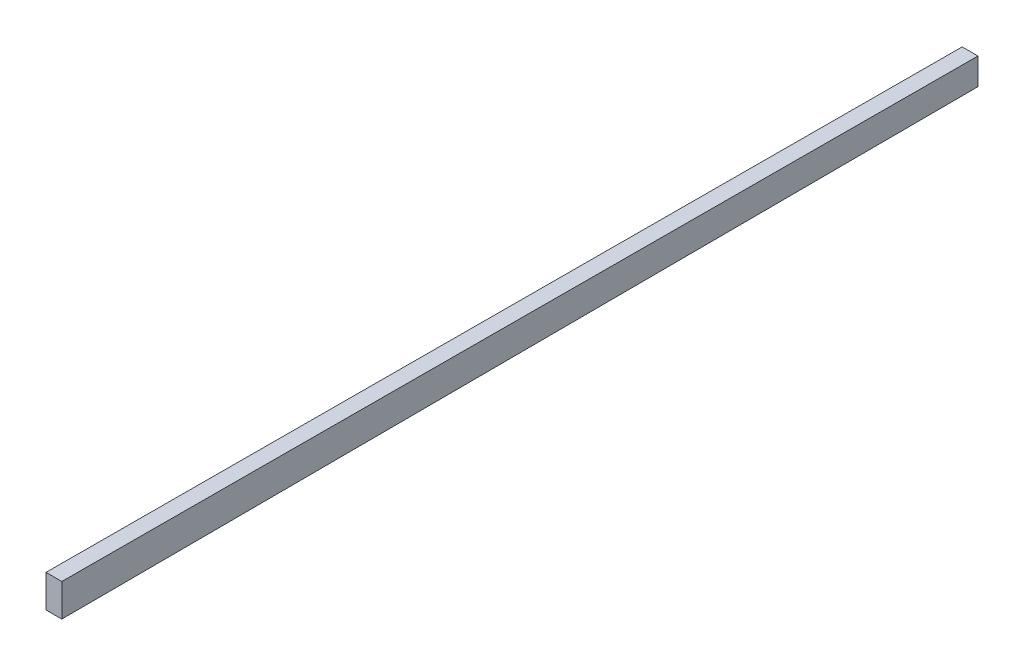
ISO-10303-21;
HEADER;
FILE_DESCRIPTION(('STEP AP214'),'2;1');
FILE_NAME('part.step','',(''),(''),'','','');
FILE_SCHEMA(('AUTOMOTIVE_DESIGN { 1 0 10303 214 1 1 1 1 }'));
ENDSEC;
DATA;
#1=APPLICATION_CONTEXT('core data for automotive mechanical design processes');
#2=APPLICATION_PROTOCOL_DEFINITION('international standard','automotive_design',2000,#1);
#3=PRODUCT_CONTEXT('',#1,'mechanical');
#4=PRODUCT('Part','Part','',(#3));
#5=PRODUCT_RELATED_PRODUCT_CATEGORY('part','',(#4));
#6=PRODUCT_DEFINITION_FORMATION('','',#4);
#7=PRODUCT_DEFINITION_CONTEXT('part definition',#1,'design');
#8=PRODUCT_DEFINITION('design','',#6,#7);
#9=PRODUCT_DEFINITION_SHAPE('','',#8);
#10=(LENGTH_UNIT() NAMED_UNIT(*) SI_UNIT(.MILLI.,.METRE.));
#11=(NAMED_UNIT(*) PLANE_ANGLE_UNIT() SI_UNIT($,.RADIAN.));
#12=(NAMED_UNIT(*) SI_UNIT($,.STERADIAN.) SOLID_ANGLE_UNIT());
#13=UNCERTAINTY_MEASURE_WITH_UNIT(LENGTH_MEASURE(1.E-05),#10,'distance_accuracy_value','');
#14=(GEOMETRIC_REPRESENTATION_CONTEXT(3) GLOBAL_UNCERTAINTY_ASSIGNED_CONTEXT((#13)) GLOBAL_UNIT_ASSIGNED_CONTEXT((#10,
#11,#12)) REPRESENTATION_CONTEXT('',''));
#15=CARTESIAN_POINT('',(0.,0.,0.));
#16=DIRECTION('',(0.,0.,1.));
#17=DIRECTION('',(1.,0.,0.));
#18=AXIS2_PLACEMENT_3D('',#15,#16,#17);
#19=CARTESIAN_POINT('',(0.,0.,368.3));
#20=DIRECTION('',(0.,0.,-1.));
#21=DIRECTION('',(-1.,0.,0.));
#22=AXIS2_PLACEMENT_3D('',#19,#20,#21);
#23=PLANE('',#22);
#24=DIRECTION('',(0.,1.,0.));
#25=VECTOR('',#24,1.);
#26=CARTESIAN_POINT('',(3.175,-6.5532,368.3));
#27=LINE('',#26,#25);
#28=CARTESIAN_POINT('',(3.175,-6.5532,368.3));
#29=VERTEX_POINT('',#28);
#30=CARTESIAN_POINT('',(3.175,6.5532,368.3));
#31=VERTEX_POINT('',#30);
#32=EDGE_CURVE('E119',#29,#31,#27,.T.);
#33=ORIENTED_EDGE('',*,*,#32,.T.);
#34=DIRECTION('',(-1.,0.,0.));
#35=VECTOR('',#34,1.);
#36=CARTESIAN_POINT('',(-3.175,6.5532,368.3));
#37=LINE('',#36,#35);
#38=CARTESIAN_POINT('',(-3.175,6.5532,368.3));
#39=VERTEX_POINT('',#38);
#40=EDGE_CURVE('E121',#31,#39,#37,.T.);
#41=ORIENTED_EDGE('',*,*,#40,.T.);
#42=DIRECTION('',(0.,-1.,0.));
#43=VECTOR('',#42,1.);
#44=CARTESIAN_POINT('',(-3.175,-6.5532,368.3));
#45=LINE('',#44,#43);
#46=CARTESIAN_POINT('',(-3.175,-6.5532,368.3));
#47=VERTEX_POINT('',#46);
#48=EDGE_CURVE('E55',#39,#47,#45,.T.);
#49=ORIENTED_EDGE('',*,*,#48,.T.);
#50=DIRECTION('',(1.,0.,0.));
#51=VECTOR('',#50,1.);
#52=CARTESIAN_POINT('',(-3.175,-6.5532,368.3));
#53=LINE('',#52,#51);
#54=EDGE_CURVE('E12',#47,#29,#53,.T.);
#55=ORIENTED_EDGE('',*,*,#54,.T.);
#56=EDGE_LOOP('',(#33,#41,#49,#55));
#57=FACE_BOUND('',#56,.T.);
#58=ADVANCED_FACE('F45',(#57),#23,.F.);
#59=CARTESIAN_POINT('',(0.,0.,0.));
#60=DIRECTION('',(0.,0.,-1.));
#61=DIRECTION('',(-1.,0.,0.));
#62=AXIS2_PLACEMENT_3D('',#59,#60,#61);
#63=PLANE('',#62);
#64=DIRECTION('',(0.,1.,0.));
#65=VECTOR('',#64,1.);
#66=CARTESIAN_POINT('',(3.175,-5.334,0.));
#67=LINE('',#66,#65);
#68=CARTESIAN_POINT('',(3.175,-5.334,0.));
#69=VERTEX_POINT('',#68);
#70=CARTESIAN_POINT('',(3.175,5.334,0.));
#71=VERTEX_POINT('',#70);
#72=EDGE_CURVE('E113',#69,#71,#67,.T.);
#73=ORIENTED_EDGE('',*,*,#72,.F.);
#74=DIRECTION('',(1.,0.,0.));
#75=VECTOR('',#74,1.);
#76=CARTESIAN_POINT('',(-3.175,-5.334,0.));
#77=LINE('',#76,#75);
#78=CARTESIAN_POINT('',(-3.175,-5.334,0.));
#79=VERTEX_POINT('',#78);
#80=EDGE_CURVE('E97',#79,#69,#77,.T.);
#81=ORIENTED_EDGE('',*,*,#80,.F.);
#82=DIRECTION('',(0.,-1.,0.));
#83=VECTOR('',#82,1.);
#84=CARTESIAN_POINT('',(-3.175,-5.334,0.));
#85=LINE('',#84,#83);
#86=CARTESIAN_POINT('',(-3.175,5.334,0.));
#87=VERTEX_POINT('',#86);
#88=EDGE_CURVE('E88',#87,#79,#85,.T.);
#89=ORIENTED_EDGE('',*,*,#88,.F.);
#90=DIRECTION('',(-1.,0.,0.));
#91=VECTOR('',#90,1.);
#92=CARTESIAN_POINT('',(-3.175,5.334,0.));
#93=LINE('',#92,#91);
#94=EDGE_CURVE('E93',#71,#87,#93,.T.);
#95=ORIENTED_EDGE('',*,*,#94,.F.);
#96=EDGE_LOOP('',(#73,#81,#89,#95));
#97=FACE_BOUND('',#96,.T.);
#98=ADVANCED_FACE('F92',(#97),#63,.T.);
#99=CARTESIAN_POINT('',(0.,-5.33394154862626,-0.0176571858161421));
#100=DIRECTION('',(0.,0.999994520853593,0.00331032668972224));
#101=DIRECTION('',(0.,-0.00331032668972224,0.999994520853593));
#102=AXIS2_PLACEMENT_3D('',#99,#100,#101);
#103=PLANE('',#102);
#104=DIRECTION('',(0.,-0.00331032668972224,0.999994520853593));
#105=VECTOR('',#104,1.);
#106=CARTESIAN_POINT('',(3.175,-5.334,0.));
#107=LINE('',#106,#105);
#108=EDGE_CURVE('E163',#69,#29,#107,.T.);
#109=ORIENTED_EDGE('',*,*,#108,.T.);
#110=ORIENTED_EDGE('',*,*,#54,.F.);
#111=DIRECTION('',(0.,-0.00331032668972224,0.999994520853593));
#112=VECTOR('',#111,1.);
#113=CARTESIAN_POINT('',(-3.175,-5.334,0.));
#114=LINE('',#113,#112);
#115=EDGE_CURVE('E70',#79,#47,#114,.T.);
#116=ORIENTED_EDGE('',*,*,#115,.F.);
#117=ORIENTED_EDGE('',*,*,#80,.T.);
#118=EDGE_LOOP('',(#109,#110,#116,#117));
#119=FACE_BOUND('',#118,.T.);
#120=ADVANCED_FACE('F144',(#119),#103,.F.);
#121=CARTESIAN_POINT('',(-3.175,0.,0.));
#122=DIRECTION('',(1.,0.,0.));
#123=DIRECTION('',(0.,0.,-1.));
#124=AXIS2_PLACEMENT_3D('',#121,#122,#123);
#125=PLANE('',#124);
#126=ORIENTED_EDGE('',*,*,#115,.T.);
#127=ORIENTED_EDGE('',*,*,#48,.F.);
#128=DIRECTION('',(0.,0.00331032668972224,0.999994520853593));
#129=VECTOR('',#128,1.);
#130=CARTESIAN_POINT('',(-3.175,5.334,0.));
#131=LINE('',#130,#129);
#132=EDGE_CURVE('E109',#87,#39,#131,.T.);
#133=ORIENTED_EDGE('',*,*,#132,.F.);
#134=ORIENTED_EDGE('',*,*,#88,.T.);
#135=EDGE_LOOP('',(#126,#127,#133,#134));
#136=FACE_BOUND('',#135,.T.);
#137=ADVANCED_FACE('F117',(#136),#125,.F.);
#138=CARTESIAN_POINT('',(3.175,0.,0.));
#139=DIRECTION('',(-1.,0.,0.));
#140=DIRECTION('',(0.,0.,1.));
#141=AXIS2_PLACEMENT_3D('',#138,#139,#140);
#142=PLANE('',#141);
#143=DIRECTION('',(0.,0.00331032668972224,0.999994520853593));
#144=VECTOR('',#143,1.);
#145=CARTESIAN_POINT('',(3.175,5.334,0.));
#146=LINE('',#145,#144);
#147=EDGE_CURVE('E112',#71,#31,#146,.T.);
#148=ORIENTED_EDGE('',*,*,#147,.T.);
#149=ORIENTED_EDGE('',*,*,#32,.F.);
#150=ORIENTED_EDGE('',*,*,#108,.F.);
#151=ORIENTED_EDGE('',*,*,#72,.T.);
#152=EDGE_LOOP('',(#148,#149,#150,#151));
#153=FACE_BOUND('',#152,.T.);
#154=ADVANCED_FACE('F143',(#153),#142,.F.);
#155=CARTESIAN_POINT('',(0.,5.33394154862626,-0.0176571858161421));
#156=DIRECTION('',(0.,-0.999994520853593,0.00331032668972224));
#157=DIRECTION('',(0.,-0.00331032668972224,-0.999994520853593));
#158=AXIS2_PLACEMENT_3D('',#155,#156,#157);
#159=PLANE('',#158);
#160=ORIENTED_EDGE('',*,*,#132,.T.);
#161=ORIENTED_EDGE('',*,*,#40,.F.);
#162=ORIENTED_EDGE('',*,*,#147,.F.);
#163=ORIENTED_EDGE('',*,*,#94,.T.);
#164=EDGE_LOOP('',(#160,#161,#162,#163));
#165=FACE_BOUND('',#164,.T.);
#166=ADVANCED_FACE('F108',(#165),#159,.F.);
#167=CLOSED_SHELL('',(#58,#98,#120,#137,#154,#166));
#168=MANIFOLD_SOLID_BREP('B2',#167);
#169=ADVANCED_BREP_SHAPE_REPRESENTATION('',(#18,#168),#14);
#170=SHAPE_DEFINITION_REPRESENTATION(#9,#169);
ENDSEC;
END-ISO-10303-21;
